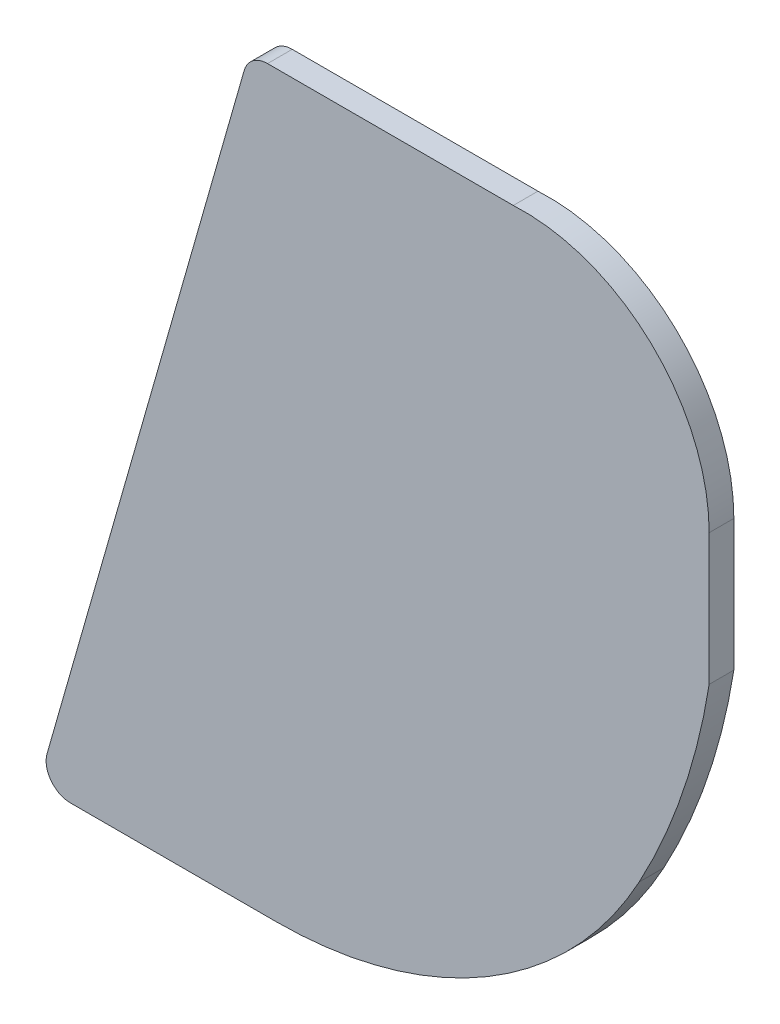
ISO-10303-21;
HEADER;
FILE_DESCRIPTION(('STEP AP214'),'2;1');
FILE_NAME('part.step','',(''),(''),'','','');
FILE_SCHEMA(('AUTOMOTIVE_DESIGN { 1 0 10303 214 1 1 1 1 }'));
ENDSEC;
DATA;
#1=APPLICATION_CONTEXT('core data for automotive mechanical design processes');
#2=APPLICATION_PROTOCOL_DEFINITION('international standard','automotive_design',2000,#1);
#3=PRODUCT_CONTEXT('',#1,'mechanical');
#4=PRODUCT('Part','Part','',(#3));
#5=PRODUCT_RELATED_PRODUCT_CATEGORY('part','',(#4));
#6=PRODUCT_DEFINITION_FORMATION('','',#4);
#7=PRODUCT_DEFINITION_CONTEXT('part definition',#1,'design');
#8=PRODUCT_DEFINITION('design','',#6,#7);
#9=PRODUCT_DEFINITION_SHAPE('','',#8);
#10=(LENGTH_UNIT() NAMED_UNIT(*) SI_UNIT(.MILLI.,.METRE.));
#11=(NAMED_UNIT(*) PLANE_ANGLE_UNIT() SI_UNIT($,.RADIAN.));
#12=(NAMED_UNIT(*) SI_UNIT($,.STERADIAN.) SOLID_ANGLE_UNIT());
#13=UNCERTAINTY_MEASURE_WITH_UNIT(LENGTH_MEASURE(1.E-05),#10,'distance_accuracy_value','');
#14=(GEOMETRIC_REPRESENTATION_CONTEXT(3) GLOBAL_UNCERTAINTY_ASSIGNED_CONTEXT((#13)) GLOBAL_UNIT_ASSIGNED_CONTEXT((#10,
#11,#12)) REPRESENTATION_CONTEXT('',''));
#15=CARTESIAN_POINT('',(0.,0.,0.));
#16=DIRECTION('',(0.,0.,1.));
#17=DIRECTION('',(1.,0.,0.));
#18=AXIS2_PLACEMENT_3D('',#15,#16,#17);
#19=CARTESIAN_POINT('',(6.28044505080831,12.3015192475189,4.75));
#20=DIRECTION('',(0.,0.,1.));
#21=DIRECTION('',(1.,0.,0.));
#22=AXIS2_PLACEMENT_3D('',#19,#20,#21);
#23=PLANE('',#22);
#24=CARTESIAN_POINT('',(6.28044505080831,12.3015192475189,4.75));
#25=DIRECTION('',(0.,0.,1.));
#26=DIRECTION('',(-3.8768037137676E-12,-1.,0.));
#27=AXIS2_PLACEMENT_3D('',#24,#25,#26);
#28=CIRCLE('',#27,0.0334487012627728);
#29=CARTESIAN_POINT('',(6.28044505080818,12.2680705462562,4.75));
#30=VERTEX_POINT('',#29);
#31=CARTESIAN_POINT('',(6.30983541741126,12.2855498402942,4.75));
#32=VERTEX_POINT('',#31);
#33=EDGE_CURVE('E11',#30,#32,#28,.T.);
#34=ORIENTED_EDGE('',*,*,#33,.F.);
#35=DIRECTION('',(1.,0.,0.));
#36=VECTOR('',#35,1.);
#37=CARTESIAN_POINT('',(6.26377367891191,12.2680705462562,4.75));
#38=LINE('',#37,#36);
#39=CARTESIAN_POINT('',(6.26377367891191,12.2680705462562,4.75));
#40=VERTEX_POINT('',#39);
#41=EDGE_CURVE('E164',#40,#30,#38,.T.);
#42=ORIENTED_EDGE('',*,*,#41,.F.);
#43=CARTESIAN_POINT('',(6.2637736789119,12.2700360746129,4.75));
#44=DIRECTION('',(0.,0.,1.));
#45=DIRECTION('',(-0.961557023269132,0.274605336805033,0.));
#46=AXIS2_PLACEMENT_3D('',#43,#44,#45);
#47=CIRCLE('',#46,0.00196552835673271);
#48=CARTESIAN_POINT('',(6.26188371131605,12.2705758191893,4.75));
#49=VERTEX_POINT('',#48);
#50=EDGE_CURVE('E157',#49,#40,#47,.T.);
#51=ORIENTED_EDGE('',*,*,#50,.F.);
#52=DIRECTION('',(-0.274605336809767,-0.96155702326778,0.));
#53=VECTOR('',#52,1.);
#54=CARTESIAN_POINT('',(6.27785190700689,12.326489993669,4.75));
#55=LINE('',#54,#53);
#56=CARTESIAN_POINT('',(6.27785190700689,12.326489993669,4.75));
#57=VERTEX_POINT('',#56);
#58=EDGE_CURVE('E148',#57,#49,#55,.T.);
#59=ORIENTED_EDGE('',*,*,#58,.F.);
#60=CARTESIAN_POINT('',(6.27974187460274,12.3259502490926,4.75));
#61=DIRECTION('',(0.,0.,1.));
#62=DIRECTION('',(4.97065462485364E-12,1.,0.));
#63=AXIS2_PLACEMENT_3D('',#60,#61,#62);
#64=CIRCLE('',#63,0.00196552835673739);
#65=CARTESIAN_POINT('',(6.27974187460275,12.3279157774493,4.75));
#66=VERTEX_POINT('',#65);
#67=EDGE_CURVE('E139',#66,#57,#64,.T.);
#68=ORIENTED_EDGE('',*,*,#67,.F.);
#69=DIRECTION('',(-1.,0.,0.));
#70=VECTOR('',#69,1.);
#71=CARTESIAN_POINT('',(6.29964469770081,12.3279157774493,4.75));
#72=LINE('',#71,#70);
#73=CARTESIAN_POINT('',(6.29964469770081,12.3279157774493,4.75));
#74=VERTEX_POINT('',#73);
#75=EDGE_CURVE('E130',#74,#66,#72,.T.);
#76=ORIENTED_EDGE('',*,*,#75,.F.);
#77=CARTESIAN_POINT('',(6.30046854277575,12.3128959139744,4.75));
#78=DIRECTION('',(0.,0.,1.));
#79=DIRECTION('',(1.,0.,0.));
#80=AXIS2_PLACEMENT_3D('',#77,#78,#79);
#81=CIRCLE('',#80,0.0150424406102673);
#82=CARTESIAN_POINT('',(6.31551098338602,12.3128959139744,4.75));
#83=VERTEX_POINT('',#82);
#84=EDGE_CURVE('E121',#83,#74,#81,.T.);
#85=ORIENTED_EDGE('',*,*,#84,.F.);
#86=DIRECTION('',(0.,1.,0.));
#87=VECTOR('',#86,1.);
#88=CARTESIAN_POINT('',(6.31551098338602,12.302257322246,4.75));
#89=LINE('',#88,#87);
#90=CARTESIAN_POINT('',(6.31551098338602,12.302257322246,4.75));
#91=VERTEX_POINT('',#90);
#92=EDGE_CURVE('E112',#91,#83,#89,.T.);
#93=ORIENTED_EDGE('',*,*,#92,.F.);
#94=CARTESIAN_POINT('',(6.26408241038586,12.310409972555,4.75));
#95=DIRECTION('',(0.,0.,1.));
#96=DIRECTION('',(0.878669888319171,-0.477429814068178,0.));
#97=AXIS2_PLACEMENT_3D('',#94,#95,#96);
#98=CIRCLE('',#97,0.052070757896285);
#99=EDGE_CURVE('E92',#32,#91,#98,.T.);
#100=ORIENTED_EDGE('',*,*,#99,.F.);
#101=EDGE_LOOP('',(#34,#42,#51,#59,#68,#76,#85,#93,#100));
#102=FACE_BOUND('',#101,.T.);
#103=ADVANCED_FACE('F17',(#102),#23,.F.);
#104=CARTESIAN_POINT('',(6.26377367891191,12.2680705462562,4.83252449867128));
#105=DIRECTION('',(0.,1.,0.));
#106=DIRECTION('',(0.,0.,1.));
#107=AXIS2_PLACEMENT_3D('',#104,#105,#106);
#108=PLANE('',#107);
#109=DIRECTION('',(0.,-8.88178419699829E-13,-1.));
#110=VECTOR('',#109,1.);
#111=CARTESIAN_POINT('',(6.28044505080818,12.2680705462562,4.752));
#112=LINE('',#111,#110);
#113=CARTESIAN_POINT('',(6.28044505080818,12.2680705462562,4.752));
#114=VERTEX_POINT('',#113);
#115=EDGE_CURVE('E24',#114,#30,#112,.T.);
#116=ORIENTED_EDGE('',*,*,#115,.F.);
#117=DIRECTION('',(-1.,0.,0.));
#118=VECTOR('',#117,1.);
#119=CARTESIAN_POINT('',(6.28044505080818,12.2680705462562,4.752));
#120=LINE('',#119,#118);
#121=CARTESIAN_POINT('',(6.26377367891191,12.2680705462562,4.752));
#122=VERTEX_POINT('',#121);
#123=EDGE_CURVE('E105',#114,#122,#120,.T.);
#124=ORIENTED_EDGE('',*,*,#123,.T.);
#125=DIRECTION('',(0.,-8.88178419699829E-13,-1.));
#126=VECTOR('',#125,1.);
#127=CARTESIAN_POINT('',(6.26377367891191,12.2680705462562,4.752));
#128=LINE('',#127,#126);
#129=EDGE_CURVE('E161',#122,#40,#128,.T.);
#130=ORIENTED_EDGE('',*,*,#129,.T.);
#131=ORIENTED_EDGE('',*,*,#41,.T.);
#132=EDGE_LOOP('',(#116,#124,#130,#131));
#133=FACE_BOUND('',#132,.T.);
#134=ADVANCED_FACE('F165',(#133),#108,.F.);
#135=CARTESIAN_POINT('',(6.2637736789119,12.2700360746129,4.83252449867128));
#136=DIRECTION('',(0.,0.,-1.));
#137=DIRECTION('',(-1.,0.,0.));
#138=AXIS2_PLACEMENT_3D('',#135,#136,#137);
#139=CYLINDRICAL_SURFACE('',#138,0.00196552835673271);
#140=ORIENTED_EDGE('',*,*,#129,.F.);
#141=CARTESIAN_POINT('',(6.2637736789119,12.2700360746129,4.752));
#142=DIRECTION('',(0.,0.,-1.));
#143=DIRECTION('',(5.42253231803685E-12,-1.,0.));
#144=AXIS2_PLACEMENT_3D('',#141,#142,#143);
#145=CIRCLE('',#144,0.00196552835673271);
#146=CARTESIAN_POINT('',(6.26188371131605,12.2705758191893,4.752));
#147=VERTEX_POINT('',#146);
#148=EDGE_CURVE('E151',#122,#147,#145,.T.);
#149=ORIENTED_EDGE('',*,*,#148,.T.);
#150=DIRECTION('',(0.,8.88178419699829E-13,-1.));
#151=VECTOR('',#150,1.);
#152=CARTESIAN_POINT('',(6.26188371131605,12.2705758191893,4.752));
#153=LINE('',#152,#151);
#154=EDGE_CURVE('E154',#147,#49,#153,.T.);
#155=ORIENTED_EDGE('',*,*,#154,.T.);
#156=ORIENTED_EDGE('',*,*,#50,.T.);
#157=EDGE_LOOP('',(#140,#149,#155,#156));
#158=FACE_BOUND('',#157,.T.);
#159=ADVANCED_FACE('F167',(#158),#139,.T.);
#160=CARTESIAN_POINT('',(6.27785190700689,12.326489993669,4.83252449867128));
#161=DIRECTION('',(0.961557023267778,-0.274605336809776,0.));
#162=DIRECTION('',(0.274605336809776,0.961557023267778,0.));
#163=AXIS2_PLACEMENT_3D('',#160,#161,#162);
#164=PLANE('',#163);
#165=ORIENTED_EDGE('',*,*,#154,.F.);
#166=DIRECTION('',(0.274605336809781,0.961557023267776,0.));
#167=VECTOR('',#166,1.);
#168=CARTESIAN_POINT('',(6.26188371131605,12.2705758191893,4.752));
#169=LINE('',#168,#167);
#170=CARTESIAN_POINT('',(6.27785190700689,12.326489993669,4.752));
#171=VERTEX_POINT('',#170);
#172=EDGE_CURVE('E142',#147,#171,#169,.T.);
#173=ORIENTED_EDGE('',*,*,#172,.T.);
#174=DIRECTION('',(0.,8.88178419699829E-13,-1.));
#175=VECTOR('',#174,1.);
#176=CARTESIAN_POINT('',(6.27785190700689,12.326489993669,4.752));
#177=LINE('',#176,#175);
#178=EDGE_CURVE('E145',#171,#57,#177,.T.);
#179=ORIENTED_EDGE('',*,*,#178,.T.);
#180=ORIENTED_EDGE('',*,*,#58,.T.);
#181=EDGE_LOOP('',(#165,#173,#179,#180));
#182=FACE_BOUND('',#181,.T.);
#183=ADVANCED_FACE('F170',(#182),#164,.F.);
#184=CARTESIAN_POINT('',(6.27974187460274,12.3259502490926,4.83252449867128));
#185=DIRECTION('',(0.,0.,-1.));
#186=DIRECTION('',(-1.,0.,0.));
#187=AXIS2_PLACEMENT_3D('',#184,#185,#186);
#188=CYLINDRICAL_SURFACE('',#187,0.00196552835673739);
#189=ORIENTED_EDGE('',*,*,#178,.F.);
#190=CARTESIAN_POINT('',(6.27974187460274,12.3259502490926,4.752));
#191=DIRECTION('',(0.,0.,-1.));
#192=DIRECTION('',(-0.961557023269064,0.274605336805272,0.));
#193=AXIS2_PLACEMENT_3D('',#190,#191,#192);
#194=CIRCLE('',#193,0.00196552835673739);
#195=CARTESIAN_POINT('',(6.27974187460275,12.3279157774493,4.752));
#196=VERTEX_POINT('',#195);
#197=EDGE_CURVE('E133',#171,#196,#194,.T.);
#198=ORIENTED_EDGE('',*,*,#197,.T.);
#199=DIRECTION('',(4.44089209849914E-13,0.,-1.));
#200=VECTOR('',#199,1.);
#201=CARTESIAN_POINT('',(6.27974187460275,12.3279157774493,4.752));
#202=LINE('',#201,#200);
#203=EDGE_CURVE('E136',#196,#66,#202,.T.);
#204=ORIENTED_EDGE('',*,*,#203,.T.);
#205=ORIENTED_EDGE('',*,*,#67,.T.);
#206=EDGE_LOOP('',(#189,#198,#204,#205));
#207=FACE_BOUND('',#206,.T.);
#208=ADVANCED_FACE('F173',(#207),#188,.T.);
#209=CARTESIAN_POINT('',(6.29964469770081,12.3279157774493,4.83252449867128));
#210=DIRECTION('',(0.,-1.,0.));
#211=DIRECTION('',(0.,0.,-1.));
#212=AXIS2_PLACEMENT_3D('',#209,#210,#211);
#213=PLANE('',#212);
#214=ORIENTED_EDGE('',*,*,#203,.F.);
#215=DIRECTION('',(1.,0.,0.));
#216=VECTOR('',#215,1.);
#217=CARTESIAN_POINT('',(6.27974187460275,12.3279157774493,4.752));
#218=LINE('',#217,#216);
#219=CARTESIAN_POINT('',(6.29964469770081,12.3279157774493,4.752));
#220=VERTEX_POINT('',#219);
#221=EDGE_CURVE('E124',#196,#220,#218,.T.);
#222=ORIENTED_EDGE('',*,*,#221,.T.);
#223=DIRECTION('',(0.,0.,-1.));
#224=VECTOR('',#223,1.);
#225=CARTESIAN_POINT('',(6.29964469770081,12.3279157774493,4.752));
#226=LINE('',#225,#224);
#227=EDGE_CURVE('E127',#220,#74,#226,.T.);
#228=ORIENTED_EDGE('',*,*,#227,.T.);
#229=ORIENTED_EDGE('',*,*,#75,.T.);
#230=EDGE_LOOP('',(#214,#222,#228,#229));
#231=FACE_BOUND('',#230,.T.);
#232=ADVANCED_FACE('F175',(#231),#213,.F.);
#233=CARTESIAN_POINT('',(6.30046854277575,12.3128959139744,4.83252449867128));
#234=DIRECTION('',(0.,0.,-1.));
#235=DIRECTION('',(-1.,0.,0.));
#236=AXIS2_PLACEMENT_3D('',#233,#234,#235);
#237=CYLINDRICAL_SURFACE('',#236,0.0150424406102673);
#238=ORIENTED_EDGE('',*,*,#227,.F.);
#239=CARTESIAN_POINT('',(6.30046854277575,12.3128959139744,4.752));
#240=DIRECTION('',(0.,0.,-1.));
#241=DIRECTION('',(-0.054768045710657,0.998499104240477,0.));
#242=AXIS2_PLACEMENT_3D('',#239,#240,#241);
#243=CIRCLE('',#242,0.0150424406102673);
#244=CARTESIAN_POINT('',(6.31551098338602,12.3128959139744,4.752));
#245=VERTEX_POINT('',#244);
#246=EDGE_CURVE('E115',#220,#245,#243,.T.);
#247=ORIENTED_EDGE('',*,*,#246,.T.);
#248=DIRECTION('',(0.,0.,-1.));
#249=VECTOR('',#248,1.);
#250=CARTESIAN_POINT('',(6.31551098338602,12.3128959139744,4.752));
#251=LINE('',#250,#249);
#252=EDGE_CURVE('E118',#245,#83,#251,.T.);
#253=ORIENTED_EDGE('',*,*,#252,.T.);
#254=ORIENTED_EDGE('',*,*,#84,.T.);
#255=EDGE_LOOP('',(#238,#247,#253,#254));
#256=FACE_BOUND('',#255,.T.);
#257=ADVANCED_FACE('F179',(#256),#237,.T.);
#258=CARTESIAN_POINT('',(6.31551098338602,12.302257322246,4.83252449867128));
#259=DIRECTION('',(-1.,0.,0.));
#260=DIRECTION('',(0.,0.,1.));
#261=AXIS2_PLACEMENT_3D('',#258,#259,#260);
#262=PLANE('',#261);
#263=ORIENTED_EDGE('',*,*,#252,.F.);
#264=DIRECTION('',(0.,-1.,0.));
#265=VECTOR('',#264,1.);
#266=CARTESIAN_POINT('',(6.31551098338602,12.3128959139744,4.752));
#267=LINE('',#266,#265);
#268=CARTESIAN_POINT('',(6.31551098338602,12.302257322246,4.752));
#269=VERTEX_POINT('',#268);
#270=EDGE_CURVE('E109',#245,#269,#267,.T.);
#271=ORIENTED_EDGE('',*,*,#270,.T.);
#272=DIRECTION('',(0.,0.,-1.));
#273=VECTOR('',#272,1.);
#274=CARTESIAN_POINT('',(6.31551098338602,12.302257322246,4.752));
#275=LINE('',#274,#273);
#276=EDGE_CURVE('E98',#269,#91,#275,.T.);
#277=ORIENTED_EDGE('',*,*,#276,.T.);
#278=ORIENTED_EDGE('',*,*,#92,.T.);
#279=EDGE_LOOP('',(#263,#271,#277,#278));
#280=FACE_BOUND('',#279,.T.);
#281=ADVANCED_FACE('F181',(#280),#262,.F.);
#282=CARTESIAN_POINT('',(6.26408241038586,12.310409972555,4.83252449867128));
#283=DIRECTION('',(0.,0.,-1.));
#284=DIRECTION('',(-1.,0.,0.));
#285=AXIS2_PLACEMENT_3D('',#282,#283,#284);
#286=CYLINDRICAL_SURFACE('',#285,0.052070757896285);
#287=ORIENTED_EDGE('',*,*,#276,.F.);
#288=CARTESIAN_POINT('',(6.26408241038586,12.310409972555,4.752));
#289=DIRECTION('',(0.,0.,-1.));
#290=DIRECTION('',(0.98766707222881,-0.156568689190945,0.));
#291=AXIS2_PLACEMENT_3D('',#288,#289,#290);
#292=CIRCLE('',#291,0.052070757896285);
#293=CARTESIAN_POINT('',(6.30983541741126,12.2855498402942,4.752));
#294=VERTEX_POINT('',#293);
#295=EDGE_CURVE('E93',#269,#294,#292,.T.);
#296=ORIENTED_EDGE('',*,*,#295,.T.);
#297=DIRECTION('',(0.,0.,-1.));
#298=VECTOR('',#297,1.);
#299=CARTESIAN_POINT('',(6.30983541741126,12.2855498402942,4.752));
#300=LINE('',#299,#298);
#301=EDGE_CURVE('E84',#294,#32,#300,.T.);
#302=ORIENTED_EDGE('',*,*,#301,.T.);
#303=ORIENTED_EDGE('',*,*,#99,.T.);
#304=EDGE_LOOP('',(#287,#296,#302,#303));
#305=FACE_BOUND('',#304,.T.);
#306=ADVANCED_FACE('F96',(#305),#286,.T.);
#307=CARTESIAN_POINT('',(6.28044505080831,12.3015192475189,4.83252449867128));
#308=DIRECTION('',(0.,0.,-1.));
#309=DIRECTION('',(-1.,0.,0.));
#310=AXIS2_PLACEMENT_3D('',#307,#308,#309);
#311=CYLINDRICAL_SURFACE('',#310,0.0334487012627728);
#312=ORIENTED_EDGE('',*,*,#301,.F.);
#313=CARTESIAN_POINT('',(6.28044505080831,12.3015192475189,4.752));
#314=DIRECTION('',(0.,0.,-1.));
#315=DIRECTION('',(0.878669888319056,-0.477429814068391,0.));
#316=AXIS2_PLACEMENT_3D('',#313,#314,#315);
#317=CIRCLE('',#316,0.0334487012627728);
#318=EDGE_CURVE('E88',#294,#114,#317,.T.);
#319=ORIENTED_EDGE('',*,*,#318,.T.);
#320=ORIENTED_EDGE('',*,*,#115,.T.);
#321=ORIENTED_EDGE('',*,*,#33,.T.);
#322=EDGE_LOOP('',(#312,#319,#320,#321));
#323=FACE_BOUND('',#322,.T.);
#324=ADVANCED_FACE('F86',(#323),#311,.T.);
#325=CARTESIAN_POINT('',(5.86959286961936,12.1314924009898,4.752));
#326=DIRECTION('',(0.,0.,-1.));
#327=DIRECTION('',(-1.,0.,0.));
#328=AXIS2_PLACEMENT_3D('',#325,#326,#327);
#329=PLANE('',#328);
#330=ORIENTED_EDGE('',*,*,#295,.F.);
#331=ORIENTED_EDGE('',*,*,#270,.F.);
#332=ORIENTED_EDGE('',*,*,#246,.F.);
#333=ORIENTED_EDGE('',*,*,#221,.F.);
#334=ORIENTED_EDGE('',*,*,#197,.F.);
#335=ORIENTED_EDGE('',*,*,#172,.F.);
#336=ORIENTED_EDGE('',*,*,#148,.F.);
#337=ORIENTED_EDGE('',*,*,#123,.F.);
#338=ORIENTED_EDGE('',*,*,#318,.F.);
#339=EDGE_LOOP('',(#330,#331,#332,#333,#334,#335,#336,#337,#338));
#340=FACE_BOUND('',#339,.T.);
#341=ADVANCED_FACE('F103',(#340),#329,.F.);
#342=CLOSED_SHELL('',(#103,#134,#159,#183,#208,#232,#257,#281,#306,#324,#341));
#343=MANIFOLD_SOLID_BREP('B1',#342);
#344=ADVANCED_BREP_SHAPE_REPRESENTATION('',(#18,#343),#14);
#345=SHAPE_DEFINITION_REPRESENTATION(#9,#344);
ENDSEC;
END-ISO-10303-21;
